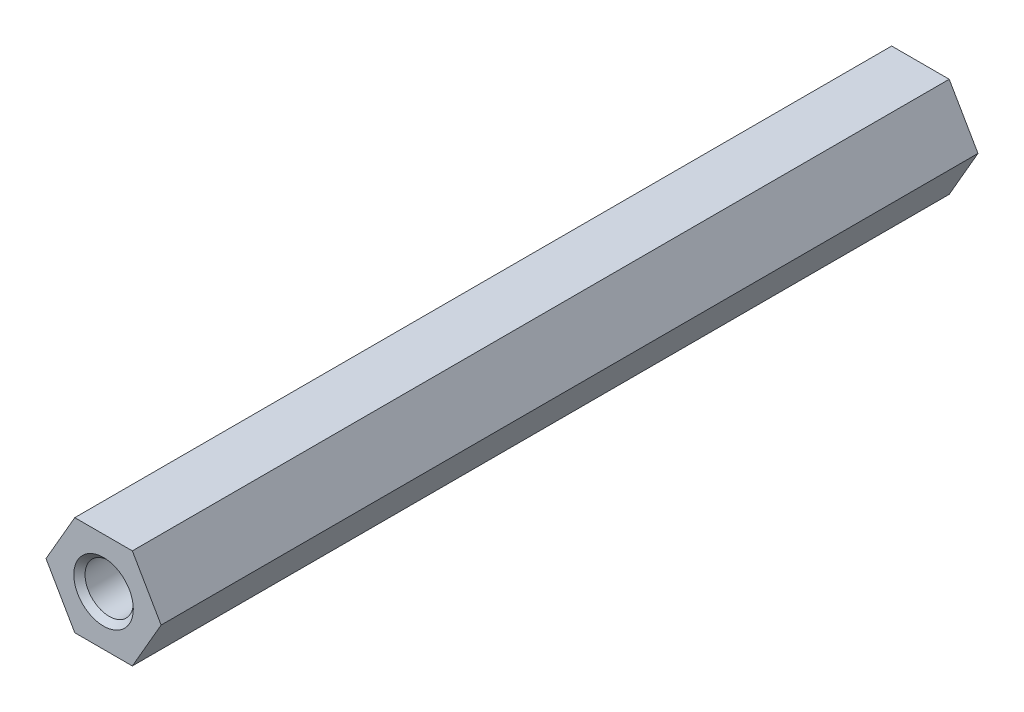
ISO-10303-21;
HEADER;
FILE_DESCRIPTION(('STEP AP214'),'2;1');
FILE_NAME('part.step','',(''),(''),'','','');
FILE_SCHEMA(('AUTOMOTIVE_DESIGN { 1 0 10303 214 1 1 1 1 }'));
ENDSEC;
DATA;
#1=APPLICATION_CONTEXT('core data for automotive mechanical design processes');
#2=APPLICATION_PROTOCOL_DEFINITION('international standard','automotive_design',2000,#1);
#3=PRODUCT_CONTEXT('',#1,'mechanical');
#4=PRODUCT('Part','Part','',(#3));
#5=PRODUCT_RELATED_PRODUCT_CATEGORY('part','',(#4));
#6=PRODUCT_DEFINITION_FORMATION('','',#4);
#7=PRODUCT_DEFINITION_CONTEXT('part definition',#1,'design');
#8=PRODUCT_DEFINITION('design','',#6,#7);
#9=PRODUCT_DEFINITION_SHAPE('','',#8);
#10=(LENGTH_UNIT() NAMED_UNIT(*) SI_UNIT(.MILLI.,.METRE.));
#11=(NAMED_UNIT(*) PLANE_ANGLE_UNIT() SI_UNIT($,.RADIAN.));
#12=(NAMED_UNIT(*) SI_UNIT($,.STERADIAN.) SOLID_ANGLE_UNIT());
#13=UNCERTAINTY_MEASURE_WITH_UNIT(LENGTH_MEASURE(1.E-05),#10,'distance_accuracy_value','');
#14=(GEOMETRIC_REPRESENTATION_CONTEXT(3) GLOBAL_UNCERTAINTY_ASSIGNED_CONTEXT((#13)) GLOBAL_UNIT_ASSIGNED_CONTEXT((#10,
#11,#12)) REPRESENTATION_CONTEXT('',''));
#15=CARTESIAN_POINT('',(0.,0.,0.));
#16=DIRECTION('',(0.,0.,1.));
#17=DIRECTION('',(1.,0.,0.));
#18=AXIS2_PLACEMENT_3D('',#15,#16,#17);
#19=CARTESIAN_POINT('',(1.78978583448784,-3.1,0.));
#20=DIRECTION('',(0.866025403784439,-0.5,0.));
#21=DIRECTION('',(0.5,0.866025403784439,0.));
#22=AXIS2_PLACEMENT_3D('',#19,#20,#21);
#23=PLANE('',#22);
#24=DIRECTION('',(0.5,0.866025403784439,0.));
#25=VECTOR('',#24,1.);
#26=CARTESIAN_POINT('',(1.78978583448784,-3.1,50.8));
#27=LINE('',#26,#25);
#28=CARTESIAN_POINT('',(1.78978583448784,-3.1,50.8));
#29=VERTEX_POINT('',#28);
#30=CARTESIAN_POINT('',(3.57957166897568,0.,50.8));
#31=VERTEX_POINT('',#30);
#32=EDGE_CURVE('E83',#29,#31,#27,.T.);
#33=ORIENTED_EDGE('',*,*,#32,.F.);
#34=DIRECTION('',(0.,0.,-1.));
#35=VECTOR('',#34,1.);
#36=CARTESIAN_POINT('',(1.78978583448784,-3.1,0.));
#37=LINE('',#36,#35);
#38=CARTESIAN_POINT('',(1.78978583448784,-3.1,0.));
#39=VERTEX_POINT('',#38);
#40=EDGE_CURVE('E71',#39,#29,#37,.F.);
#41=ORIENTED_EDGE('',*,*,#40,.F.);
#42=DIRECTION('',(0.5,0.866025403784439,0.));
#43=VECTOR('',#42,1.);
#44=CARTESIAN_POINT('',(1.78978583448784,-3.1,0.));
#45=LINE('',#44,#43);
#46=CARTESIAN_POINT('',(3.57957166897568,0.,0.));
#47=VERTEX_POINT('',#46);
#48=EDGE_CURVE('E125',#39,#47,#45,.T.);
#49=ORIENTED_EDGE('',*,*,#48,.T.);
#50=DIRECTION('',(0.,0.,1.));
#51=VECTOR('',#50,1.);
#52=CARTESIAN_POINT('',(3.57957166897568,0.,0.));
#53=LINE('',#52,#51);
#54=EDGE_CURVE('E87',#31,#47,#53,.F.);
#55=ORIENTED_EDGE('',*,*,#54,.F.);
#56=EDGE_LOOP('',(#33,#41,#49,#55));
#57=FACE_BOUND('',#56,.T.);
#58=ADVANCED_FACE('F18',(#57),#23,.T.);
#59=CARTESIAN_POINT('',(3.57957166897568,0.,0.));
#60=DIRECTION('',(0.866025403784438,0.5,0.));
#61=DIRECTION('',(-0.5,0.866025403784438,0.));
#62=AXIS2_PLACEMENT_3D('',#59,#60,#61);
#63=PLANE('',#62);
#64=DIRECTION('',(-0.5,0.866025403784439,0.));
#65=VECTOR('',#64,1.);
#66=CARTESIAN_POINT('',(3.57957166897568,0.,50.8));
#67=LINE('',#66,#65);
#68=CARTESIAN_POINT('',(1.78978583448784,3.1,50.8));
#69=VERTEX_POINT('',#68);
#70=EDGE_CURVE('E89',#31,#69,#67,.T.);
#71=ORIENTED_EDGE('',*,*,#70,.F.);
#72=ORIENTED_EDGE('',*,*,#54,.T.);
#73=DIRECTION('',(-0.5,0.866025403784439,0.));
#74=VECTOR('',#73,1.);
#75=CARTESIAN_POINT('',(3.57957166897568,0.,0.));
#76=LINE('',#75,#74);
#77=CARTESIAN_POINT('',(1.78978583448784,3.1,0.));
#78=VERTEX_POINT('',#77);
#79=EDGE_CURVE('E122',#47,#78,#76,.T.);
#80=ORIENTED_EDGE('',*,*,#79,.T.);
#81=DIRECTION('',(0.,0.,1.));
#82=VECTOR('',#81,1.);
#83=CARTESIAN_POINT('',(1.78978583448784,3.1,0.));
#84=LINE('',#83,#82);
#85=EDGE_CURVE('E99',#69,#78,#84,.F.);
#86=ORIENTED_EDGE('',*,*,#85,.F.);
#87=EDGE_LOOP('',(#71,#72,#80,#86));
#88=FACE_BOUND('',#87,.T.);
#89=ADVANCED_FACE('F228',(#88),#63,.T.);
#90=CARTESIAN_POINT('',(1.78978583448784,3.1,0.));
#91=DIRECTION('',(0.,1.,0.));
#92=DIRECTION('',(0.,0.,1.));
#93=AXIS2_PLACEMENT_3D('',#90,#91,#92);
#94=PLANE('',#93);
#95=DIRECTION('',(1.,0.,0.));
#96=VECTOR('',#95,1.);
#97=CARTESIAN_POINT('',(0.,3.1,50.8));
#98=LINE('',#97,#96);
#99=CARTESIAN_POINT('',(-1.78978583448784,3.1,50.8));
#100=VERTEX_POINT('',#99);
#101=EDGE_CURVE('E91',#69,#100,#98,.F.);
#102=ORIENTED_EDGE('',*,*,#101,.F.);
#103=ORIENTED_EDGE('',*,*,#85,.T.);
#104=DIRECTION('',(1.,0.,0.));
#105=VECTOR('',#104,1.);
#106=CARTESIAN_POINT('',(0.,3.1,0.));
#107=LINE('',#106,#105);
#108=CARTESIAN_POINT('',(-1.78978583448784,3.1,0.));
#109=VERTEX_POINT('',#108);
#110=EDGE_CURVE('E119',#78,#109,#107,.F.);
#111=ORIENTED_EDGE('',*,*,#110,.T.);
#112=DIRECTION('',(0.,0.,1.));
#113=VECTOR('',#112,1.);
#114=CARTESIAN_POINT('',(-1.78978583448784,3.1,0.));
#115=LINE('',#114,#113);
#116=EDGE_CURVE('E97',#100,#109,#115,.F.);
#117=ORIENTED_EDGE('',*,*,#116,.F.);
#118=EDGE_LOOP('',(#102,#103,#111,#117));
#119=FACE_BOUND('',#118,.T.);
#120=ADVANCED_FACE('F135',(#119),#94,.T.);
#121=CARTESIAN_POINT('',(-1.78978583448784,3.1,0.));
#122=DIRECTION('',(-0.866025403784439,0.5,0.));
#123=DIRECTION('',(-0.5,-0.866025403784439,0.));
#124=AXIS2_PLACEMENT_3D('',#121,#122,#123);
#125=PLANE('',#124);
#126=DIRECTION('',(-0.5,-0.866025403784439,0.));
#127=VECTOR('',#126,1.);
#128=CARTESIAN_POINT('',(-1.78978583448784,3.1,50.8));
#129=LINE('',#128,#127);
#130=CARTESIAN_POINT('',(-3.57957166897568,0.,50.8));
#131=VERTEX_POINT('',#130);
#132=EDGE_CURVE('E128',#100,#131,#129,.T.);
#133=ORIENTED_EDGE('',*,*,#132,.F.);
#134=ORIENTED_EDGE('',*,*,#116,.T.);
#135=DIRECTION('',(-0.5,-0.866025403784439,0.));
#136=VECTOR('',#135,1.);
#137=CARTESIAN_POINT('',(-1.78978583448784,3.1,0.));
#138=LINE('',#137,#136);
#139=CARTESIAN_POINT('',(-3.57957166897568,0.,0.));
#140=VERTEX_POINT('',#139);
#141=EDGE_CURVE('E112',#109,#140,#138,.T.);
#142=ORIENTED_EDGE('',*,*,#141,.T.);
#143=DIRECTION('',(0.,0.,1.));
#144=VECTOR('',#143,1.);
#145=CARTESIAN_POINT('',(-3.57957166897568,0.,0.));
#146=LINE('',#145,#144);
#147=EDGE_CURVE('E79',#131,#140,#146,.F.);
#148=ORIENTED_EDGE('',*,*,#147,.F.);
#149=EDGE_LOOP('',(#133,#134,#142,#148));
#150=FACE_BOUND('',#149,.T.);
#151=ADVANCED_FACE('F139',(#150),#125,.T.);
#152=CARTESIAN_POINT('',(-3.57957166897568,0.,0.));
#153=DIRECTION('',(-0.866025403784439,-0.5,0.));
#154=DIRECTION('',(0.5,-0.866025403784439,0.));
#155=AXIS2_PLACEMENT_3D('',#152,#153,#154);
#156=PLANE('',#155);
#157=DIRECTION('',(0.5,-0.866025403784439,0.));
#158=VECTOR('',#157,1.);
#159=CARTESIAN_POINT('',(-3.57957166897568,0.,50.8));
#160=LINE('',#159,#158);
#161=CARTESIAN_POINT('',(-1.78978583448784,-3.1,50.8));
#162=VERTEX_POINT('',#161);
#163=EDGE_CURVE('E85',#131,#162,#160,.T.);
#164=ORIENTED_EDGE('',*,*,#163,.F.);
#165=ORIENTED_EDGE('',*,*,#147,.T.);
#166=DIRECTION('',(0.5,-0.866025403784439,0.));
#167=VECTOR('',#166,1.);
#168=CARTESIAN_POINT('',(-3.57957166897568,0.,0.));
#169=LINE('',#168,#167);
#170=CARTESIAN_POINT('',(-1.78978583448784,-3.1,0.));
#171=VERTEX_POINT('',#170);
#172=EDGE_CURVE('E110',#140,#171,#169,.T.);
#173=ORIENTED_EDGE('',*,*,#172,.T.);
#174=DIRECTION('',(0.,0.,-1.));
#175=VECTOR('',#174,1.);
#176=CARTESIAN_POINT('',(-1.78978583448784,-3.1,0.));
#177=LINE('',#176,#175);
#178=EDGE_CURVE('E36',#162,#171,#177,.T.);
#179=ORIENTED_EDGE('',*,*,#178,.F.);
#180=EDGE_LOOP('',(#164,#165,#173,#179));
#181=FACE_BOUND('',#180,.T.);
#182=ADVANCED_FACE('F141',(#181),#156,.T.);
#183=CARTESIAN_POINT('',(-1.78978583448784,-3.1,0.));
#184=DIRECTION('',(0.,-1.,0.));
#185=DIRECTION('',(0.,0.,-1.));
#186=AXIS2_PLACEMENT_3D('',#183,#184,#185);
#187=PLANE('',#186);
#188=DIRECTION('',(1.,0.,0.));
#189=VECTOR('',#188,1.);
#190=CARTESIAN_POINT('',(0.,-3.1,50.8));
#191=LINE('',#190,#189);
#192=EDGE_CURVE('E74',#162,#29,#191,.T.);
#193=ORIENTED_EDGE('',*,*,#192,.F.);
#194=ORIENTED_EDGE('',*,*,#178,.T.);
#195=DIRECTION('',(1.,0.,0.));
#196=VECTOR('',#195,1.);
#197=CARTESIAN_POINT('',(0.,-3.1,0.));
#198=LINE('',#197,#196);
#199=EDGE_CURVE('E75',#171,#39,#198,.T.);
#200=ORIENTED_EDGE('',*,*,#199,.T.);
#201=ORIENTED_EDGE('',*,*,#40,.T.);
#202=EDGE_LOOP('',(#193,#194,#200,#201));
#203=FACE_BOUND('',#202,.T.);
#204=ADVANCED_FACE('F73',(#203),#187,.T.);
#205=CARTESIAN_POINT('',(0.,0.,50.8));
#206=DIRECTION('',(0.,0.,1.));
#207=DIRECTION('',(1.,0.,0.));
#208=AXIS2_PLACEMENT_3D('',#205,#206,#207);
#209=PLANE('',#208);
#210=CARTESIAN_POINT('',(0.,0.,50.8000000000948));
#211=DIRECTION('',(0.,0.,1.));
#212=DIRECTION('',(1.,0.,0.));
#213=AXIS2_PLACEMENT_3D('',#210,#211,#212);
#214=CIRCLE('',#213,1.84999999993352);
#215=CARTESIAN_POINT('',(1.84999999993353,0.,50.8000000000948));
#216=VERTEX_POINT('',#215);
#217=EDGE_CURVE('E21',#216,#216,#214,.F.);
#218=ORIENTED_EDGE('',*,*,#217,.T.);
#219=EDGE_LOOP('',(#218));
#220=FACE_BOUND('',#219,.T.);
#221=ORIENTED_EDGE('',*,*,#132,.T.);
#222=ORIENTED_EDGE('',*,*,#163,.T.);
#223=ORIENTED_EDGE('',*,*,#192,.T.);
#224=ORIENTED_EDGE('',*,*,#32,.T.);
#225=ORIENTED_EDGE('',*,*,#70,.T.);
#226=ORIENTED_EDGE('',*,*,#101,.T.);
#227=EDGE_LOOP('',(#221,#222,#223,#224,#225,#226));
#228=FACE_BOUND('',#227,.T.);
#229=ADVANCED_FACE('F82',(#220,#228),#209,.T.);
#230=CARTESIAN_POINT('',(0.,0.,0.));
#231=DIRECTION('',(0.,0.,1.));
#232=DIRECTION('',(1.,0.,0.));
#233=AXIS2_PLACEMENT_3D('',#230,#231,#232);
#234=PLANE('',#233);
#235=CARTESIAN_POINT('',(0.,0.,0.));
#236=DIRECTION('',(0.,0.,-1.));
#237=DIRECTION('',(-1.,0.,0.));
#238=AXIS2_PLACEMENT_3D('',#235,#236,#237);
#239=CIRCLE('',#238,1.84999999993352);
#240=CARTESIAN_POINT('',(-1.84999999993352,0.,0.));
#241=VERTEX_POINT('',#240);
#242=EDGE_CURVE('E101',#241,#241,#239,.F.);
#243=ORIENTED_EDGE('',*,*,#242,.T.);
#244=EDGE_LOOP('',(#243));
#245=FACE_BOUND('',#244,.T.);
#246=ORIENTED_EDGE('',*,*,#172,.F.);
#247=ORIENTED_EDGE('',*,*,#141,.F.);
#248=ORIENTED_EDGE('',*,*,#110,.F.);
#249=ORIENTED_EDGE('',*,*,#79,.F.);
#250=ORIENTED_EDGE('',*,*,#48,.F.);
#251=ORIENTED_EDGE('',*,*,#199,.F.);
#252=EDGE_LOOP('',(#246,#247,#248,#249,#250,#251));
#253=FACE_BOUND('',#252,.T.);
#254=ADVANCED_FACE('F167',(#245,#253),#234,.F.);
#255=CARTESIAN_POINT('',(0.,0.,50.8000000000379));
#256=DIRECTION('',(0.,0.,1.));
#257=DIRECTION('',(1.,0.,0.));
#258=AXIS2_PLACEMENT_3D('',#255,#256,#257);
#259=CONICAL_SURFACE('',#258,1.84999999987667,0.785398163397448);
#260=CARTESIAN_POINT('',(0.,0.,50.45));
#261=DIRECTION('',(0.,0.,-1.));
#262=DIRECTION('',(-1.,0.,0.));
#263=AXIS2_PLACEMENT_3D('',#260,#261,#262);
#264=CIRCLE('',#263,1.5);
#265=CARTESIAN_POINT('',(-1.5,0.,50.45));
#266=VERTEX_POINT('',#265);
#267=EDGE_CURVE('E27',#266,#266,#264,.T.);
#268=ORIENTED_EDGE('',*,*,#267,.T.);
#269=EDGE_LOOP('',(#268));
#270=FACE_BOUND('',#269,.T.);
#271=ORIENTED_EDGE('',*,*,#217,.F.);
#272=EDGE_LOOP('',(#271));
#273=FACE_BOUND('',#272,.T.);
#274=ADVANCED_FACE('F159',(#270,#273),#259,.F.);
#275=CARTESIAN_POINT('',(0.,0.,5.6843418860808E-11));
#276=DIRECTION('',(0.,0.,-1.));
#277=DIRECTION('',(-1.,0.,0.));
#278=AXIS2_PLACEMENT_3D('',#275,#276,#277);
#279=CONICAL_SURFACE('',#278,1.84999999987667,0.785398163397448);
#280=CARTESIAN_POINT('',(0.,0.,0.350000000000003));
#281=DIRECTION('',(0.,0.,-1.));
#282=DIRECTION('',(-1.,0.,0.));
#283=AXIS2_PLACEMENT_3D('',#280,#281,#282);
#284=CIRCLE('',#283,1.5);
#285=CARTESIAN_POINT('',(-1.5,0.,0.350000000000003));
#286=VERTEX_POINT('',#285);
#287=EDGE_CURVE('E11',#286,#286,#284,.F.);
#288=ORIENTED_EDGE('',*,*,#287,.T.);
#289=EDGE_LOOP('',(#288));
#290=FACE_BOUND('',#289,.T.);
#291=ORIENTED_EDGE('',*,*,#242,.F.);
#292=EDGE_LOOP('',(#291));
#293=FACE_BOUND('',#292,.T.);
#294=ADVANCED_FACE('F153',(#290,#293),#279,.F.);
#295=CARTESIAN_POINT('',(0.,0.,50.8));
#296=DIRECTION('',(0.,0.,-1.));
#297=DIRECTION('',(-1.,0.,0.));
#298=AXIS2_PLACEMENT_3D('',#295,#296,#297);
#299=CYLINDRICAL_SURFACE('',#298,1.5);
#300=ORIENTED_EDGE('',*,*,#287,.F.);
#301=EDGE_LOOP('',(#300));
#302=FACE_BOUND('',#301,.T.);
#303=ORIENTED_EDGE('',*,*,#267,.F.);
#304=EDGE_LOOP('',(#303));
#305=FACE_BOUND('',#304,.T.);
#306=ADVANCED_FACE('F151',(#302,#305),#299,.F.);
#307=CLOSED_SHELL('',(#58,#89,#120,#151,#182,#204,#229,#254,#274,#294,#306));
#308=MANIFOLD_SOLID_BREP('B1',#307);
#309=ADVANCED_BREP_SHAPE_REPRESENTATION('',(#18,#308),#14);
#310=SHAPE_DEFINITION_REPRESENTATION(#9,#309);
ENDSEC;
END-ISO-10303-21;
